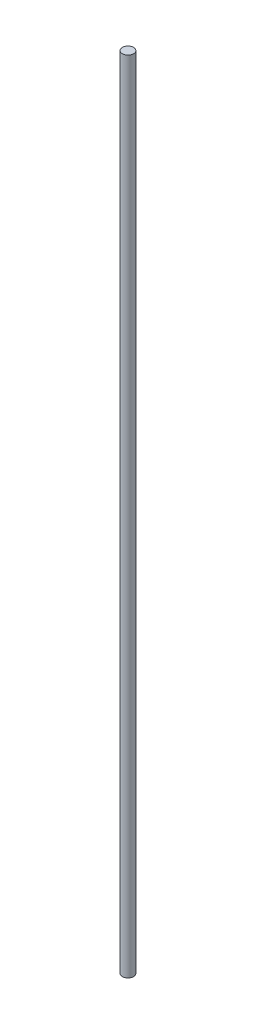
ISO-10303-21;
HEADER;
FILE_DESCRIPTION(('STEP AP214'),'2;1');
FILE_NAME('part.step','',(''),(''),'','','');
FILE_SCHEMA(('AUTOMOTIVE_DESIGN { 1 0 10303 214 1 1 1 1 }'));
ENDSEC;
DATA;
#1=APPLICATION_CONTEXT('core data for automotive mechanical design processes');
#2=APPLICATION_PROTOCOL_DEFINITION('international standard','automotive_design',2000,#1);
#3=PRODUCT_CONTEXT('',#1,'mechanical');
#4=PRODUCT('Part','Part','',(#3));
#5=PRODUCT_RELATED_PRODUCT_CATEGORY('part','',(#4));
#6=PRODUCT_DEFINITION_FORMATION('','',#4);
#7=PRODUCT_DEFINITION_CONTEXT('part definition',#1,'design');
#8=PRODUCT_DEFINITION('design','',#6,#7);
#9=PRODUCT_DEFINITION_SHAPE('','',#8);
#10=(LENGTH_UNIT() NAMED_UNIT(*) SI_UNIT(.MILLI.,.METRE.));
#11=(NAMED_UNIT(*) PLANE_ANGLE_UNIT() SI_UNIT($,.RADIAN.));
#12=(NAMED_UNIT(*) SI_UNIT($,.STERADIAN.) SOLID_ANGLE_UNIT());
#13=UNCERTAINTY_MEASURE_WITH_UNIT(LENGTH_MEASURE(1.E-05),#10,'distance_accuracy_value','');
#14=(GEOMETRIC_REPRESENTATION_CONTEXT(3) GLOBAL_UNCERTAINTY_ASSIGNED_CONTEXT((#13)) GLOBAL_UNIT_ASSIGNED_CONTEXT((#10,
#11,#12)) REPRESENTATION_CONTEXT('',''));
#15=CARTESIAN_POINT('',(0.,0.,0.));
#16=DIRECTION('',(0.,0.,1.));
#17=DIRECTION('',(1.,0.,0.));
#18=AXIS2_PLACEMENT_3D('',#15,#16,#17);
#19=CARTESIAN_POINT('',(0.,358.5,0.));
#20=DIRECTION('',(0.,-1.,0.));
#21=DIRECTION('',(0.,0.,-1.));
#22=AXIS2_PLACEMENT_3D('',#19,#20,#21);
#23=CYLINDRICAL_SURFACE('',#22,2.5);
#24=CARTESIAN_POINT('',(0.,358.5,0.));
#25=DIRECTION('',(0.,1.,0.));
#26=DIRECTION('',(0.,0.,1.));
#27=AXIS2_PLACEMENT_3D('',#24,#25,#26);
#28=CIRCLE('',#27,2.5);
#29=CARTESIAN_POINT('',(0.,358.5,2.5));
#30=VERTEX_POINT('',#29);
#31=EDGE_CURVE('E10',#30,#30,#28,.T.);
#32=ORIENTED_EDGE('',*,*,#31,.F.);
#33=EDGE_LOOP('',(#32));
#34=FACE_BOUND('',#33,.T.);
#35=CARTESIAN_POINT('',(0.,0.,0.));
#36=DIRECTION('',(0.,1.,0.));
#37=DIRECTION('',(0.,0.,1.));
#38=AXIS2_PLACEMENT_3D('',#35,#36,#37);
#39=CIRCLE('',#38,2.5);
#40=CARTESIAN_POINT('',(0.,0.,2.5));
#41=VERTEX_POINT('',#40);
#42=EDGE_CURVE('E36',#41,#41,#39,.T.);
#43=ORIENTED_EDGE('',*,*,#42,.T.);
#44=EDGE_LOOP('',(#43));
#45=FACE_BOUND('',#44,.T.);
#46=ADVANCED_FACE('F33',(#34,#45),#23,.T.);
#47=CARTESIAN_POINT('',(0.,358.5,0.));
#48=DIRECTION('',(0.,1.,0.));
#49=DIRECTION('',(0.,0.,1.));
#50=AXIS2_PLACEMENT_3D('',#47,#48,#49);
#51=PLANE('',#50);
#52=ORIENTED_EDGE('',*,*,#31,.T.);
#53=EDGE_LOOP('',(#52));
#54=FACE_BOUND('',#53,.T.);
#55=ADVANCED_FACE('F48',(#54),#51,.T.);
#56=CARTESIAN_POINT('',(0.,0.,0.));
#57=DIRECTION('',(0.,1.,0.));
#58=DIRECTION('',(0.,0.,1.));
#59=AXIS2_PLACEMENT_3D('',#56,#57,#58);
#60=PLANE('',#59);
#61=ORIENTED_EDGE('',*,*,#42,.F.);
#62=EDGE_LOOP('',(#61));
#63=FACE_BOUND('',#62,.T.);
#64=ADVANCED_FACE('F46',(#63),#60,.F.);
#65=CLOSED_SHELL('',(#46,#55,#64));
#66=MANIFOLD_SOLID_BREP('B2',#65);
#67=ADVANCED_BREP_SHAPE_REPRESENTATION('',(#18,#66),#14);
#68=SHAPE_DEFINITION_REPRESENTATION(#9,#67);
ENDSEC;
END-ISO-10303-21;
